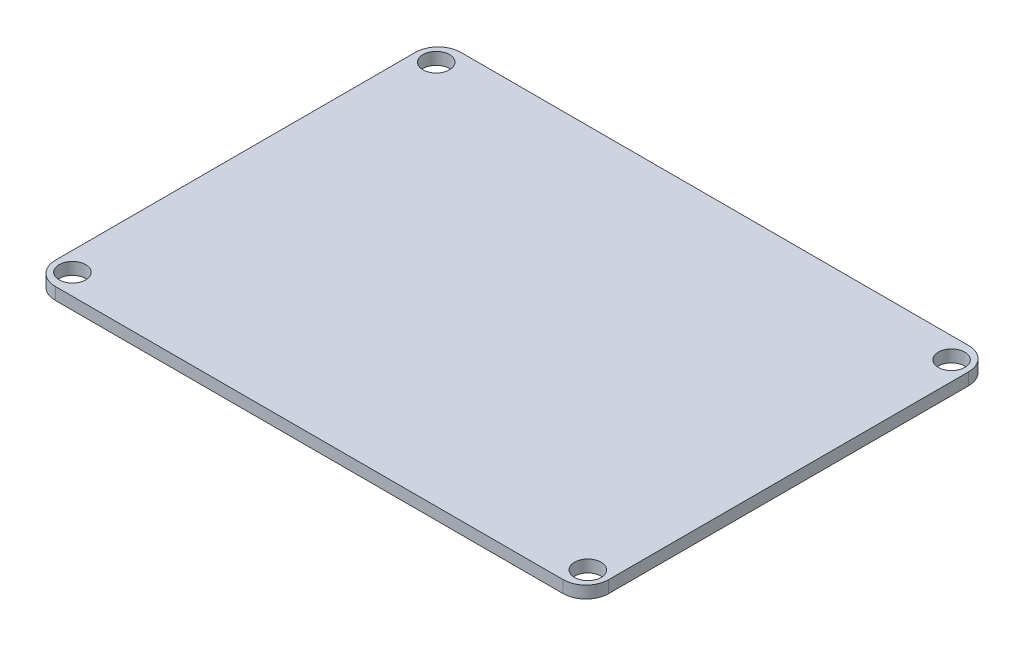
ISO-10303-21;
HEADER;
FILE_DESCRIPTION(('STEP AP214'),'2;1');
FILE_NAME('part.step','',(''),(''),'','','');
FILE_SCHEMA(('AUTOMOTIVE_DESIGN { 1 0 10303 214 1 1 1 1 }'));
ENDSEC;
DATA;
#1=APPLICATION_CONTEXT('core data for automotive mechanical design processes');
#2=APPLICATION_PROTOCOL_DEFINITION('international standard','automotive_design',2000,#1);
#3=PRODUCT_CONTEXT('',#1,'mechanical');
#4=PRODUCT('Part','Part','',(#3));
#5=PRODUCT_RELATED_PRODUCT_CATEGORY('part','',(#4));
#6=PRODUCT_DEFINITION_FORMATION('','',#4);
#7=PRODUCT_DEFINITION_CONTEXT('part definition',#1,'design');
#8=PRODUCT_DEFINITION('design','',#6,#7);
#9=PRODUCT_DEFINITION_SHAPE('','',#8);
#10=(LENGTH_UNIT() NAMED_UNIT(*) SI_UNIT(.MILLI.,.METRE.));
#11=(NAMED_UNIT(*) PLANE_ANGLE_UNIT() SI_UNIT($,.RADIAN.));
#12=(NAMED_UNIT(*) SI_UNIT($,.STERADIAN.) SOLID_ANGLE_UNIT());
#13=UNCERTAINTY_MEASURE_WITH_UNIT(LENGTH_MEASURE(1.E-05),#10,'distance_accuracy_value','');
#14=(GEOMETRIC_REPRESENTATION_CONTEXT(3) GLOBAL_UNCERTAINTY_ASSIGNED_CONTEXT((#13)) GLOBAL_UNIT_ASSIGNED_CONTEXT((#10,
#11,#12)) REPRESENTATION_CONTEXT('',''));
#15=CARTESIAN_POINT('',(0.,0.,0.));
#16=DIRECTION('',(0.,0.,1.));
#17=DIRECTION('',(1.,0.,0.));
#18=AXIS2_PLACEMENT_3D('',#15,#16,#17);
#19=CARTESIAN_POINT('',(0.,1.6,0.));
#20=DIRECTION('',(0.,1.,0.));
#21=DIRECTION('',(0.,0.,1.));
#22=AXIS2_PLACEMENT_3D('',#19,#20,#21);
#23=PLANE('',#22);
#24=CARTESIAN_POINT('',(34.,1.6,24.));
#25=DIRECTION('',(0.,1.,0.));
#26=DIRECTION('',(0.,0.,1.));
#27=AXIS2_PLACEMENT_3D('',#24,#25,#26);
#28=CIRCLE('',#27,1.75);
#29=CARTESIAN_POINT('',(34.,1.6,25.75));
#30=VERTEX_POINT('',#29);
#31=EDGE_CURVE('E187',#30,#30,#28,.T.);
#32=ORIENTED_EDGE('',*,*,#31,.F.);
#33=EDGE_LOOP('',(#32));
#34=FACE_BOUND('',#33,.T.);
#35=CARTESIAN_POINT('',(34.,1.6,-24.));
#36=DIRECTION('',(0.,1.,0.));
#37=DIRECTION('',(0.,0.,1.));
#38=AXIS2_PLACEMENT_3D('',#35,#36,#37);
#39=CIRCLE('',#38,1.75);
#40=CARTESIAN_POINT('',(34.,1.6,-22.25));
#41=VERTEX_POINT('',#40);
#42=EDGE_CURVE('E128',#41,#41,#39,.T.);
#43=ORIENTED_EDGE('',*,*,#42,.F.);
#44=EDGE_LOOP('',(#43));
#45=FACE_BOUND('',#44,.T.);
#46=DIRECTION('',(-1.,0.,0.));
#47=VECTOR('',#46,1.);
#48=CARTESIAN_POINT('',(36.5,1.6,-26.75));
#49=LINE('',#48,#47);
#50=CARTESIAN_POINT('',(33.5,1.6,-26.75));
#51=VERTEX_POINT('',#50);
#52=CARTESIAN_POINT('',(-33.5,1.6,-26.75));
#53=VERTEX_POINT('',#52);
#54=EDGE_CURVE('E137',#51,#53,#49,.T.);
#55=ORIENTED_EDGE('',*,*,#54,.T.);
#56=CARTESIAN_POINT('',(-33.5,1.6,-23.75));
#57=DIRECTION('',(0.,1.,0.));
#58=DIRECTION('',(0.,0.,1.));
#59=AXIS2_PLACEMENT_3D('',#56,#57,#58);
#60=CIRCLE('',#59,3.);
#61=CARTESIAN_POINT('',(-36.5,1.6,-23.75));
#62=VERTEX_POINT('',#61);
#63=EDGE_CURVE('E156',#53,#62,#60,.T.);
#64=ORIENTED_EDGE('',*,*,#63,.T.);
#65=DIRECTION('',(0.,0.,1.));
#66=VECTOR('',#65,1.);
#67=CARTESIAN_POINT('',(-36.5,1.6,26.75));
#68=LINE('',#67,#66);
#69=CARTESIAN_POINT('',(-36.5,1.6,23.75));
#70=VERTEX_POINT('',#69);
#71=EDGE_CURVE('E120',#62,#70,#68,.T.);
#72=ORIENTED_EDGE('',*,*,#71,.T.);
#73=CARTESIAN_POINT('',(-33.5,1.6,23.75));
#74=DIRECTION('',(0.,1.,0.));
#75=DIRECTION('',(0.,0.,1.));
#76=AXIS2_PLACEMENT_3D('',#73,#74,#75);
#77=CIRCLE('',#76,3.);
#78=CARTESIAN_POINT('',(-33.5,1.6,26.75));
#79=VERTEX_POINT('',#78);
#80=EDGE_CURVE('E151',#70,#79,#77,.T.);
#81=ORIENTED_EDGE('',*,*,#80,.T.);
#82=DIRECTION('',(1.,0.,0.));
#83=VECTOR('',#82,1.);
#84=CARTESIAN_POINT('',(36.5,1.6,26.75));
#85=LINE('',#84,#83);
#86=CARTESIAN_POINT('',(33.5,1.6,26.75));
#87=VERTEX_POINT('',#86);
#88=EDGE_CURVE('E167',#79,#87,#85,.T.);
#89=ORIENTED_EDGE('',*,*,#88,.T.);
#90=CARTESIAN_POINT('',(33.5,1.6,23.75));
#91=DIRECTION('',(0.,1.,0.));
#92=DIRECTION('',(0.,0.,1.));
#93=AXIS2_PLACEMENT_3D('',#90,#91,#92);
#94=CIRCLE('',#93,3.);
#95=CARTESIAN_POINT('',(36.5,1.6,23.75));
#96=VERTEX_POINT('',#95);
#97=EDGE_CURVE('E56',#87,#96,#94,.T.);
#98=ORIENTED_EDGE('',*,*,#97,.T.);
#99=DIRECTION('',(0.,0.,-1.));
#100=VECTOR('',#99,1.);
#101=CARTESIAN_POINT('',(36.5,1.6,26.75));
#102=LINE('',#101,#100);
#103=CARTESIAN_POINT('',(36.5,1.6,-23.75));
#104=VERTEX_POINT('',#103);
#105=EDGE_CURVE('E175',#96,#104,#102,.T.);
#106=ORIENTED_EDGE('',*,*,#105,.T.);
#107=CARTESIAN_POINT('',(33.5,1.6,-23.75));
#108=DIRECTION('',(0.,1.,0.));
#109=DIRECTION('',(0.,0.,1.));
#110=AXIS2_PLACEMENT_3D('',#107,#108,#109);
#111=CIRCLE('',#110,3.);
#112=EDGE_CURVE('E154',#104,#51,#111,.T.);
#113=ORIENTED_EDGE('',*,*,#112,.T.);
#114=EDGE_LOOP('',(#55,#64,#72,#81,#89,#98,#106,#113));
#115=FACE_BOUND('',#114,.T.);
#116=CARTESIAN_POINT('',(-34.,1.6,-24.));
#117=DIRECTION('',(0.,1.,0.));
#118=DIRECTION('',(0.,0.,1.));
#119=AXIS2_PLACEMENT_3D('',#116,#117,#118);
#120=CIRCLE('',#119,1.75);
#121=CARTESIAN_POINT('',(-34.,1.6,-22.25));
#122=VERTEX_POINT('',#121);
#123=EDGE_CURVE('E182',#122,#122,#120,.T.);
#124=ORIENTED_EDGE('',*,*,#123,.F.);
#125=EDGE_LOOP('',(#124));
#126=FACE_BOUND('',#125,.T.);
#127=CARTESIAN_POINT('',(-34.,1.6,24.));
#128=DIRECTION('',(0.,1.,0.));
#129=DIRECTION('',(0.,0.,1.));
#130=AXIS2_PLACEMENT_3D('',#127,#128,#129);
#131=CIRCLE('',#130,1.75);
#132=CARTESIAN_POINT('',(-34.,1.6,25.75));
#133=VERTEX_POINT('',#132);
#134=EDGE_CURVE('E193',#133,#133,#131,.T.);
#135=ORIENTED_EDGE('',*,*,#134,.F.);
#136=EDGE_LOOP('',(#135));
#137=FACE_BOUND('',#136,.T.);
#138=ADVANCED_FACE('F34',(#34,#45,#115,#126,#137),#23,.T.);
#139=CARTESIAN_POINT('',(0.,0.,0.));
#140=DIRECTION('',(0.,1.,0.));
#141=DIRECTION('',(0.,0.,1.));
#142=AXIS2_PLACEMENT_3D('',#139,#140,#141);
#143=PLANE('',#142);
#144=DIRECTION('',(0.,0.,1.));
#145=VECTOR('',#144,1.);
#146=CARTESIAN_POINT('',(-36.5,0.,26.75));
#147=LINE('',#146,#145);
#148=CARTESIAN_POINT('',(-36.5,0.,-23.75));
#149=VERTEX_POINT('',#148);
#150=CARTESIAN_POINT('',(-36.5,0.,23.75));
#151=VERTEX_POINT('',#150);
#152=EDGE_CURVE('E117',#149,#151,#147,.T.);
#153=ORIENTED_EDGE('',*,*,#152,.F.);
#154=CARTESIAN_POINT('',(-33.5,0.,-23.75));
#155=DIRECTION('',(0.,1.,0.));
#156=DIRECTION('',(0.,0.,1.));
#157=AXIS2_PLACEMENT_3D('',#154,#155,#156);
#158=CIRCLE('',#157,3.);
#159=CARTESIAN_POINT('',(-33.5,0.,-26.75));
#160=VERTEX_POINT('',#159);
#161=EDGE_CURVE('E100',#149,#160,#158,.F.);
#162=ORIENTED_EDGE('',*,*,#161,.T.);
#163=DIRECTION('',(-1.,0.,0.));
#164=VECTOR('',#163,1.);
#165=CARTESIAN_POINT('',(36.5,0.,-26.75));
#166=LINE('',#165,#164);
#167=CARTESIAN_POINT('',(33.5,0.,-26.75));
#168=VERTEX_POINT('',#167);
#169=EDGE_CURVE('E141',#168,#160,#166,.T.);
#170=ORIENTED_EDGE('',*,*,#169,.F.);
#171=CARTESIAN_POINT('',(33.5,0.,-23.75));
#172=DIRECTION('',(0.,1.,0.));
#173=DIRECTION('',(0.,0.,1.));
#174=AXIS2_PLACEMENT_3D('',#171,#172,#173);
#175=CIRCLE('',#174,3.);
#176=CARTESIAN_POINT('',(36.5,0.,-23.75));
#177=VERTEX_POINT('',#176);
#178=EDGE_CURVE('E111',#168,#177,#175,.F.);
#179=ORIENTED_EDGE('',*,*,#178,.T.);
#180=DIRECTION('',(0.,0.,-1.));
#181=VECTOR('',#180,1.);
#182=CARTESIAN_POINT('',(36.5,0.,26.75));
#183=LINE('',#182,#181);
#184=CARTESIAN_POINT('',(36.5,0.,23.75));
#185=VERTEX_POINT('',#184);
#186=EDGE_CURVE('E131',#185,#177,#183,.T.);
#187=ORIENTED_EDGE('',*,*,#186,.F.);
#188=CARTESIAN_POINT('',(33.5,0.,23.75));
#189=DIRECTION('',(0.,1.,0.));
#190=DIRECTION('',(0.,0.,1.));
#191=AXIS2_PLACEMENT_3D('',#188,#189,#190);
#192=CIRCLE('',#191,3.);
#193=CARTESIAN_POINT('',(33.5,0.,26.75));
#194=VERTEX_POINT('',#193);
#195=EDGE_CURVE('E145',#185,#194,#192,.F.);
#196=ORIENTED_EDGE('',*,*,#195,.T.);
#197=DIRECTION('',(1.,0.,0.));
#198=VECTOR('',#197,1.);
#199=CARTESIAN_POINT('',(36.5,0.,26.75));
#200=LINE('',#199,#198);
#201=CARTESIAN_POINT('',(-33.5,0.,26.75));
#202=VERTEX_POINT('',#201);
#203=EDGE_CURVE('E127',#202,#194,#200,.T.);
#204=ORIENTED_EDGE('',*,*,#203,.F.);
#205=CARTESIAN_POINT('',(-33.5,0.,23.75));
#206=DIRECTION('',(0.,1.,0.));
#207=DIRECTION('',(0.,0.,1.));
#208=AXIS2_PLACEMENT_3D('',#205,#206,#207);
#209=CIRCLE('',#208,3.);
#210=EDGE_CURVE('E121',#202,#151,#209,.F.);
#211=ORIENTED_EDGE('',*,*,#210,.T.);
#212=EDGE_LOOP('',(#153,#162,#170,#179,#187,#196,#204,#211));
#213=FACE_BOUND('',#212,.T.);
#214=CARTESIAN_POINT('',(34.,0.,-24.));
#215=DIRECTION('',(0.,1.,0.));
#216=DIRECTION('',(0.,0.,1.));
#217=AXIS2_PLACEMENT_3D('',#214,#215,#216);
#218=CIRCLE('',#217,1.75);
#219=CARTESIAN_POINT('',(34.,0.,-22.25));
#220=VERTEX_POINT('',#219);
#221=EDGE_CURVE('E134',#220,#220,#218,.T.);
#222=ORIENTED_EDGE('',*,*,#221,.T.);
#223=EDGE_LOOP('',(#222));
#224=FACE_BOUND('',#223,.T.);
#225=CARTESIAN_POINT('',(-34.,0.,-24.));
#226=DIRECTION('',(0.,1.,0.));
#227=DIRECTION('',(0.,0.,1.));
#228=AXIS2_PLACEMENT_3D('',#225,#226,#227);
#229=CIRCLE('',#228,1.75);
#230=CARTESIAN_POINT('',(-34.,0.,-22.25));
#231=VERTEX_POINT('',#230);
#232=EDGE_CURVE('E184',#231,#231,#229,.T.);
#233=ORIENTED_EDGE('',*,*,#232,.T.);
#234=EDGE_LOOP('',(#233));
#235=FACE_BOUND('',#234,.T.);
#236=CARTESIAN_POINT('',(34.,0.,24.));
#237=DIRECTION('',(0.,1.,0.));
#238=DIRECTION('',(0.,0.,1.));
#239=AXIS2_PLACEMENT_3D('',#236,#237,#238);
#240=CIRCLE('',#239,1.75);
#241=CARTESIAN_POINT('',(34.,0.,25.75));
#242=VERTEX_POINT('',#241);
#243=EDGE_CURVE('E190',#242,#242,#240,.T.);
#244=ORIENTED_EDGE('',*,*,#243,.T.);
#245=EDGE_LOOP('',(#244));
#246=FACE_BOUND('',#245,.T.);
#247=CARTESIAN_POINT('',(-34.,0.,24.));
#248=DIRECTION('',(0.,1.,0.));
#249=DIRECTION('',(0.,0.,1.));
#250=AXIS2_PLACEMENT_3D('',#247,#248,#249);
#251=CIRCLE('',#250,1.75);
#252=CARTESIAN_POINT('',(-34.,0.,25.75));
#253=VERTEX_POINT('',#252);
#254=EDGE_CURVE('E196',#253,#253,#251,.T.);
#255=ORIENTED_EDGE('',*,*,#254,.T.);
#256=EDGE_LOOP('',(#255));
#257=FACE_BOUND('',#256,.T.);
#258=ADVANCED_FACE('F124',(#213,#224,#235,#246,#257),#143,.F.);
#259=CARTESIAN_POINT('',(-36.5,1.6,26.75));
#260=DIRECTION('',(1.,0.,0.));
#261=DIRECTION('',(0.,0.,-1.));
#262=AXIS2_PLACEMENT_3D('',#259,#260,#261);
#263=PLANE('',#262);
#264=ORIENTED_EDGE('',*,*,#71,.F.);
#265=DIRECTION('',(0.,-1.,0.));
#266=VECTOR('',#265,1.);
#267=CARTESIAN_POINT('',(-36.5,1.6,-23.75));
#268=LINE('',#267,#266);
#269=EDGE_CURVE('E104',#62,#149,#268,.T.);
#270=ORIENTED_EDGE('',*,*,#269,.T.);
#271=ORIENTED_EDGE('',*,*,#152,.T.);
#272=DIRECTION('',(0.,-1.,0.));
#273=VECTOR('',#272,1.);
#274=CARTESIAN_POINT('',(-36.5,1.6,23.75));
#275=LINE('',#274,#273);
#276=EDGE_CURVE('E122',#151,#70,#275,.F.);
#277=ORIENTED_EDGE('',*,*,#276,.T.);
#278=EDGE_LOOP('',(#264,#270,#271,#277));
#279=FACE_BOUND('',#278,.T.);
#280=ADVANCED_FACE('F116',(#279),#263,.F.);
#281=CARTESIAN_POINT('',(36.5,1.6,26.75));
#282=DIRECTION('',(0.,0.,-1.));
#283=DIRECTION('',(-1.,0.,0.));
#284=AXIS2_PLACEMENT_3D('',#281,#282,#283);
#285=PLANE('',#284);
#286=ORIENTED_EDGE('',*,*,#203,.T.);
#287=DIRECTION('',(0.,-1.,0.));
#288=VECTOR('',#287,1.);
#289=CARTESIAN_POINT('',(33.5,1.6,26.75));
#290=LINE('',#289,#288);
#291=EDGE_CURVE('E11',#194,#87,#290,.F.);
#292=ORIENTED_EDGE('',*,*,#291,.T.);
#293=ORIENTED_EDGE('',*,*,#88,.F.);
#294=DIRECTION('',(0.,-1.,0.));
#295=VECTOR('',#294,1.);
#296=CARTESIAN_POINT('',(-33.5,1.6,26.75));
#297=LINE('',#296,#295);
#298=EDGE_CURVE('E42',#79,#202,#297,.T.);
#299=ORIENTED_EDGE('',*,*,#298,.T.);
#300=EDGE_LOOP('',(#286,#292,#293,#299));
#301=FACE_BOUND('',#300,.T.);
#302=ADVANCED_FACE('F165',(#301),#285,.F.);
#303=CARTESIAN_POINT('',(36.5,1.6,26.75));
#304=DIRECTION('',(-1.,0.,0.));
#305=DIRECTION('',(0.,0.,1.));
#306=AXIS2_PLACEMENT_3D('',#303,#304,#305);
#307=PLANE('',#306);
#308=ORIENTED_EDGE('',*,*,#186,.T.);
#309=DIRECTION('',(0.,-1.,0.));
#310=VECTOR('',#309,1.);
#311=CARTESIAN_POINT('',(36.5,1.6,-23.75));
#312=LINE('',#311,#310);
#313=EDGE_CURVE('E49',#177,#104,#312,.F.);
#314=ORIENTED_EDGE('',*,*,#313,.T.);
#315=ORIENTED_EDGE('',*,*,#105,.F.);
#316=DIRECTION('',(0.,-1.,0.));
#317=VECTOR('',#316,1.);
#318=CARTESIAN_POINT('',(36.5,1.6,23.75));
#319=LINE('',#318,#317);
#320=EDGE_CURVE('E158',#96,#185,#319,.T.);
#321=ORIENTED_EDGE('',*,*,#320,.T.);
#322=EDGE_LOOP('',(#308,#314,#315,#321));
#323=FACE_BOUND('',#322,.T.);
#324=ADVANCED_FACE('F174',(#323),#307,.F.);
#325=CARTESIAN_POINT('',(36.5,1.6,-26.75));
#326=DIRECTION('',(0.,0.,1.));
#327=DIRECTION('',(1.,0.,0.));
#328=AXIS2_PLACEMENT_3D('',#325,#326,#327);
#329=PLANE('',#328);
#330=ORIENTED_EDGE('',*,*,#169,.T.);
#331=DIRECTION('',(0.,-1.,0.));
#332=VECTOR('',#331,1.);
#333=CARTESIAN_POINT('',(-33.5,1.6,-26.75));
#334=LINE('',#333,#332);
#335=EDGE_CURVE('E105',#160,#53,#334,.F.);
#336=ORIENTED_EDGE('',*,*,#335,.T.);
#337=ORIENTED_EDGE('',*,*,#54,.F.);
#338=DIRECTION('',(0.,-1.,0.));
#339=VECTOR('',#338,1.);
#340=CARTESIAN_POINT('',(33.5,1.6,-26.75));
#341=LINE('',#340,#339);
#342=EDGE_CURVE('E110',#51,#168,#341,.T.);
#343=ORIENTED_EDGE('',*,*,#342,.T.);
#344=EDGE_LOOP('',(#330,#336,#337,#343));
#345=FACE_BOUND('',#344,.T.);
#346=ADVANCED_FACE('F218',(#345),#329,.F.);
#347=CARTESIAN_POINT('',(34.,1.6,-24.));
#348=DIRECTION('',(0.,-1.,0.));
#349=DIRECTION('',(0.,0.,-1.));
#350=AXIS2_PLACEMENT_3D('',#347,#348,#349);
#351=CYLINDRICAL_SURFACE('',#350,1.75);
#352=ORIENTED_EDGE('',*,*,#42,.T.);
#353=EDGE_LOOP('',(#352));
#354=FACE_BOUND('',#353,.T.);
#355=ORIENTED_EDGE('',*,*,#221,.F.);
#356=EDGE_LOOP('',(#355));
#357=FACE_BOUND('',#356,.T.);
#358=ADVANCED_FACE('F215',(#354,#357),#351,.F.);
#359=CARTESIAN_POINT('',(-34.,1.6,-24.));
#360=DIRECTION('',(0.,-1.,0.));
#361=DIRECTION('',(0.,0.,-1.));
#362=AXIS2_PLACEMENT_3D('',#359,#360,#361);
#363=CYLINDRICAL_SURFACE('',#362,1.75);
#364=ORIENTED_EDGE('',*,*,#123,.T.);
#365=EDGE_LOOP('',(#364));
#366=FACE_BOUND('',#365,.T.);
#367=ORIENTED_EDGE('',*,*,#232,.F.);
#368=EDGE_LOOP('',(#367));
#369=FACE_BOUND('',#368,.T.);
#370=ADVANCED_FACE('F244',(#366,#369),#363,.F.);
#371=CARTESIAN_POINT('',(34.,1.6,24.));
#372=DIRECTION('',(0.,-1.,0.));
#373=DIRECTION('',(0.,0.,-1.));
#374=AXIS2_PLACEMENT_3D('',#371,#372,#373);
#375=CYLINDRICAL_SURFACE('',#374,1.75);
#376=ORIENTED_EDGE('',*,*,#31,.T.);
#377=EDGE_LOOP('',(#376));
#378=FACE_BOUND('',#377,.T.);
#379=ORIENTED_EDGE('',*,*,#243,.F.);
#380=EDGE_LOOP('',(#379));
#381=FACE_BOUND('',#380,.T.);
#382=ADVANCED_FACE('F247',(#378,#381),#375,.F.);
#383=CARTESIAN_POINT('',(-34.,1.6,24.));
#384=DIRECTION('',(0.,-1.,0.));
#385=DIRECTION('',(0.,0.,-1.));
#386=AXIS2_PLACEMENT_3D('',#383,#384,#385);
#387=CYLINDRICAL_SURFACE('',#386,1.75);
#388=ORIENTED_EDGE('',*,*,#134,.T.);
#389=EDGE_LOOP('',(#388));
#390=FACE_BOUND('',#389,.T.);
#391=ORIENTED_EDGE('',*,*,#254,.F.);
#392=EDGE_LOOP('',(#391));
#393=FACE_BOUND('',#392,.T.);
#394=ADVANCED_FACE('F202',(#390,#393),#387,.F.);
#395=CARTESIAN_POINT('',(-33.5,1.6,-23.75));
#396=DIRECTION('',(0.,-1.,0.));
#397=DIRECTION('',(0.,0.,-1.));
#398=AXIS2_PLACEMENT_3D('',#395,#396,#397);
#399=CYLINDRICAL_SURFACE('',#398,3.);
#400=ORIENTED_EDGE('',*,*,#63,.F.);
#401=ORIENTED_EDGE('',*,*,#335,.F.);
#402=ORIENTED_EDGE('',*,*,#161,.F.);
#403=ORIENTED_EDGE('',*,*,#269,.F.);
#404=EDGE_LOOP('',(#400,#401,#402,#403));
#405=FACE_BOUND('',#404,.T.);
#406=ADVANCED_FACE('F103',(#405),#399,.T.);
#407=CARTESIAN_POINT('',(33.5,1.6,-23.75));
#408=DIRECTION('',(0.,-1.,0.));
#409=DIRECTION('',(0.,0.,-1.));
#410=AXIS2_PLACEMENT_3D('',#407,#408,#409);
#411=CYLINDRICAL_SURFACE('',#410,3.);
#412=ORIENTED_EDGE('',*,*,#112,.F.);
#413=ORIENTED_EDGE('',*,*,#313,.F.);
#414=ORIENTED_EDGE('',*,*,#178,.F.);
#415=ORIENTED_EDGE('',*,*,#342,.F.);
#416=EDGE_LOOP('',(#412,#413,#414,#415));
#417=FACE_BOUND('',#416,.T.);
#418=ADVANCED_FACE('F230',(#417),#411,.T.);
#419=CARTESIAN_POINT('',(33.5,1.6,23.75));
#420=DIRECTION('',(0.,-1.,0.));
#421=DIRECTION('',(0.,0.,-1.));
#422=AXIS2_PLACEMENT_3D('',#419,#420,#421);
#423=CYLINDRICAL_SURFACE('',#422,3.);
#424=ORIENTED_EDGE('',*,*,#97,.F.);
#425=ORIENTED_EDGE('',*,*,#291,.F.);
#426=ORIENTED_EDGE('',*,*,#195,.F.);
#427=ORIENTED_EDGE('',*,*,#320,.F.);
#428=EDGE_LOOP('',(#424,#425,#426,#427));
#429=FACE_BOUND('',#428,.T.);
#430=ADVANCED_FACE('F173',(#429),#423,.T.);
#431=CARTESIAN_POINT('',(-33.5,1.6,23.75));
#432=DIRECTION('',(0.,-1.,0.));
#433=DIRECTION('',(0.,0.,-1.));
#434=AXIS2_PLACEMENT_3D('',#431,#432,#433);
#435=CYLINDRICAL_SURFACE('',#434,3.);
#436=ORIENTED_EDGE('',*,*,#80,.F.);
#437=ORIENTED_EDGE('',*,*,#276,.F.);
#438=ORIENTED_EDGE('',*,*,#210,.F.);
#439=ORIENTED_EDGE('',*,*,#298,.F.);
#440=EDGE_LOOP('',(#436,#437,#438,#439));
#441=FACE_BOUND('',#440,.T.);
#442=ADVANCED_FACE('F36',(#441),#435,.T.);
#443=CLOSED_SHELL('',(#138,#258,#280,#302,#324,#346,#358,#370,#382,#394,#406,#418,#430,#442));
#444=MANIFOLD_SOLID_BREP('B2',#443);
#445=ADVANCED_BREP_SHAPE_REPRESENTATION('',(#18,#444),#14);
#446=SHAPE_DEFINITION_REPRESENTATION(#9,#445);
ENDSEC;
END-ISO-10303-21;
